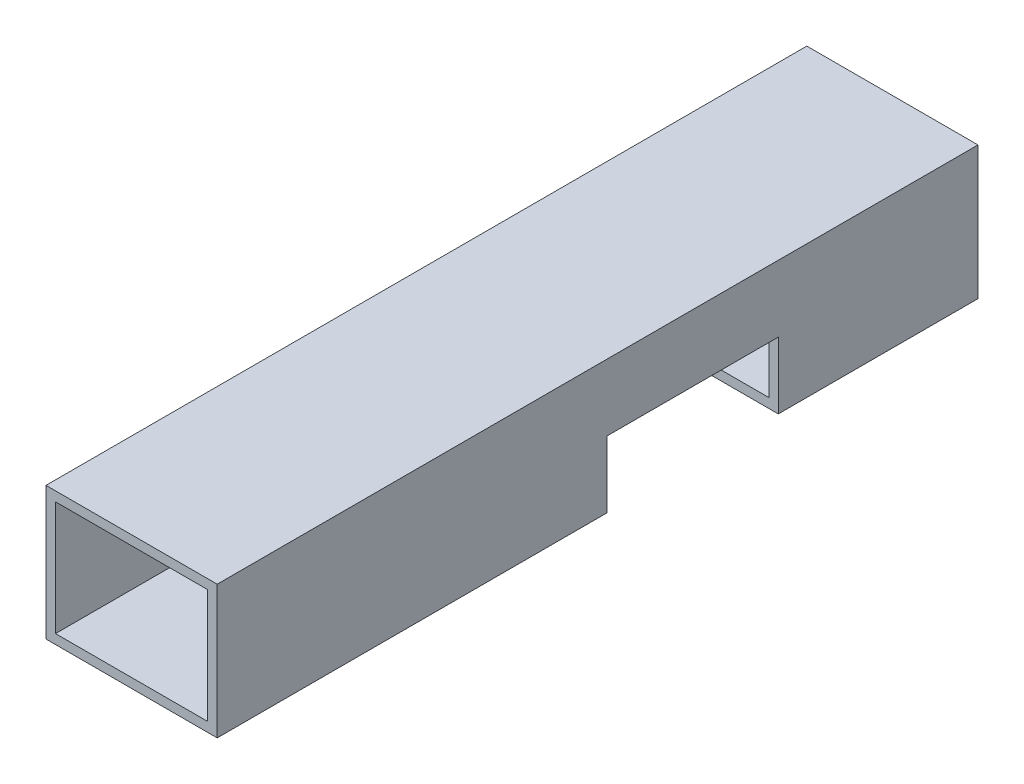
ISO-10303-21;
HEADER;
FILE_DESCRIPTION(('STEP AP214'),'2;1');
FILE_NAME('part.step','',(''),(''),'','','');
FILE_SCHEMA(('AUTOMOTIVE_DESIGN { 1 0 10303 214 1 1 1 1 }'));
ENDSEC;
DATA;
#1=APPLICATION_CONTEXT('core data for automotive mechanical design processes');
#2=APPLICATION_PROTOCOL_DEFINITION('international standard','automotive_design',2000,#1);
#3=PRODUCT_CONTEXT('',#1,'mechanical');
#4=PRODUCT('Part','Part','',(#3));
#5=PRODUCT_RELATED_PRODUCT_CATEGORY('part','',(#4));
#6=PRODUCT_DEFINITION_FORMATION('','',#4);
#7=PRODUCT_DEFINITION_CONTEXT('part definition',#1,'design');
#8=PRODUCT_DEFINITION('design','',#6,#7);
#9=PRODUCT_DEFINITION_SHAPE('','',#8);
#10=(LENGTH_UNIT() NAMED_UNIT(*) SI_UNIT(.MILLI.,.METRE.));
#11=(NAMED_UNIT(*) PLANE_ANGLE_UNIT() SI_UNIT($,.RADIAN.));
#12=(NAMED_UNIT(*) SI_UNIT($,.STERADIAN.) SOLID_ANGLE_UNIT());
#13=UNCERTAINTY_MEASURE_WITH_UNIT(LENGTH_MEASURE(1.E-05),#10,'distance_accuracy_value','');
#14=(GEOMETRIC_REPRESENTATION_CONTEXT(3) GLOBAL_UNCERTAINTY_ASSIGNED_CONTEXT((#13)) GLOBAL_UNIT_ASSIGNED_CONTEXT((#10,
#11,#12)) REPRESENTATION_CONTEXT('',''));
#15=CARTESIAN_POINT('',(0.,0.,0.));
#16=DIRECTION('',(0.,0.,1.));
#17=DIRECTION('',(1.,0.,0.));
#18=AXIS2_PLACEMENT_3D('',#15,#16,#17);
#19=CARTESIAN_POINT('',(0.,0.,40.));
#20=DIRECTION('',(0.,1.,0.));
#21=DIRECTION('',(0.,0.,1.));
#22=AXIS2_PLACEMENT_3D('',#19,#20,#21);
#23=PLANE('',#22);
#24=DIRECTION('',(0.,0.,-1.));
#25=VECTOR('',#24,1.);
#26=CARTESIAN_POINT('',(9.,0.,40.));
#27=LINE('',#26,#25);
#28=CARTESIAN_POINT('',(9.,0.,10.5));
#29=VERTEX_POINT('',#28);
#30=CARTESIAN_POINT('',(9.,0.,0.));
#31=VERTEX_POINT('',#30);
#32=EDGE_CURVE('E170',#29,#31,#27,.T.);
#33=ORIENTED_EDGE('',*,*,#32,.F.);
#34=DIRECTION('',(1.,0.,0.));
#35=VECTOR('',#34,1.);
#36=CARTESIAN_POINT('',(-41.,0.,10.5));
#37=LINE('',#36,#35);
#38=CARTESIAN_POINT('',(0.,0.,10.5));
#39=VERTEX_POINT('',#38);
#40=EDGE_CURVE('E163',#39,#29,#37,.T.);
#41=ORIENTED_EDGE('',*,*,#40,.F.);
#42=DIRECTION('',(0.,0.,-1.));
#43=VECTOR('',#42,1.);
#44=CARTESIAN_POINT('',(0.,0.,40.));
#45=LINE('',#44,#43);
#46=CARTESIAN_POINT('',(0.,0.,0.));
#47=VERTEX_POINT('',#46);
#48=EDGE_CURVE('E169',#39,#47,#45,.T.);
#49=ORIENTED_EDGE('',*,*,#48,.T.);
#50=DIRECTION('',(1.,0.,0.));
#51=VECTOR('',#50,1.);
#52=CARTESIAN_POINT('',(0.,0.,0.));
#53=LINE('',#52,#51);
#54=EDGE_CURVE('E230',#47,#31,#53,.T.);
#55=ORIENTED_EDGE('',*,*,#54,.T.);
#56=EDGE_LOOP('',(#33,#41,#49,#55));
#57=FACE_BOUND('',#56,.T.);
#58=ADVANCED_FACE('F33',(#57),#23,.F.);
#59=CARTESIAN_POINT('',(0.500000000000001,0.499999999999999,40.));
#60=DIRECTION('',(0.,1.,0.));
#61=DIRECTION('',(0.,0.,1.));
#62=AXIS2_PLACEMENT_3D('',#59,#60,#61);
#63=PLANE('',#62);
#64=DIRECTION('',(-1.,0.,0.));
#65=VECTOR('',#64,1.);
#66=CARTESIAN_POINT('',(0.500000000000001,0.499999999999999,10.5));
#67=LINE('',#66,#65);
#68=CARTESIAN_POINT('',(8.5,0.499999999999999,10.5));
#69=VERTEX_POINT('',#68);
#70=CARTESIAN_POINT('',(0.500000000000001,0.499999999999999,10.5));
#71=VERTEX_POINT('',#70);
#72=EDGE_CURVE('E41',#69,#71,#67,.T.);
#73=ORIENTED_EDGE('',*,*,#72,.F.);
#74=DIRECTION('',(0.,0.,-1.));
#75=VECTOR('',#74,1.);
#76=CARTESIAN_POINT('',(8.5,0.499999999999999,40.));
#77=LINE('',#76,#75);
#78=CARTESIAN_POINT('',(8.5,0.499999999999999,0.));
#79=VERTEX_POINT('',#78);
#80=EDGE_CURVE('E209',#69,#79,#77,.T.);
#81=ORIENTED_EDGE('',*,*,#80,.T.);
#82=DIRECTION('',(1.,0.,0.));
#83=VECTOR('',#82,1.);
#84=CARTESIAN_POINT('',(0.500000000000001,0.499999999999999,0.));
#85=LINE('',#84,#83);
#86=CARTESIAN_POINT('',(0.500000000000001,0.499999999999999,0.));
#87=VERTEX_POINT('',#86);
#88=EDGE_CURVE('E201',#87,#79,#85,.T.);
#89=ORIENTED_EDGE('',*,*,#88,.F.);
#90=DIRECTION('',(0.,0.,-1.));
#91=VECTOR('',#90,1.);
#92=CARTESIAN_POINT('',(0.500000000000001,0.499999999999999,40.));
#93=LINE('',#92,#91);
#94=EDGE_CURVE('E195',#71,#87,#93,.T.);
#95=ORIENTED_EDGE('',*,*,#94,.F.);
#96=EDGE_LOOP('',(#73,#81,#89,#95));
#97=FACE_BOUND('',#96,.T.);
#98=ADVANCED_FACE('F199',(#97),#63,.T.);
#99=CARTESIAN_POINT('',(0.,7.,40.));
#100=DIRECTION('',(0.,0.,-1.));
#101=DIRECTION('',(-1.,0.,0.));
#102=AXIS2_PLACEMENT_3D('',#99,#100,#101);
#103=PLANE('',#102);
#104=DIRECTION('',(0.,-1.,0.));
#105=VECTOR('',#104,1.);
#106=CARTESIAN_POINT('',(0.,0.,40.));
#107=LINE('',#106,#105);
#108=CARTESIAN_POINT('',(0.,7.,40.));
#109=VERTEX_POINT('',#108);
#110=CARTESIAN_POINT('',(0.,0.,40.));
#111=VERTEX_POINT('',#110);
#112=EDGE_CURVE('E218',#109,#111,#107,.T.);
#113=ORIENTED_EDGE('',*,*,#112,.T.);
#114=DIRECTION('',(1.,0.,0.));
#115=VECTOR('',#114,1.);
#116=CARTESIAN_POINT('',(0.,0.,40.));
#117=LINE('',#116,#115);
#118=CARTESIAN_POINT('',(9.,0.,40.));
#119=VERTEX_POINT('',#118);
#120=EDGE_CURVE('E221',#111,#119,#117,.T.);
#121=ORIENTED_EDGE('',*,*,#120,.T.);
#122=DIRECTION('',(0.,1.,0.));
#123=VECTOR('',#122,1.);
#124=CARTESIAN_POINT('',(9.,0.,40.));
#125=LINE('',#124,#123);
#126=CARTESIAN_POINT('',(9.,7.,40.));
#127=VERTEX_POINT('',#126);
#128=EDGE_CURVE('E168',#119,#127,#125,.T.);
#129=ORIENTED_EDGE('',*,*,#128,.T.);
#130=DIRECTION('',(-1.,0.,0.));
#131=VECTOR('',#130,1.);
#132=CARTESIAN_POINT('',(0.,7.,40.));
#133=LINE('',#132,#131);
#134=EDGE_CURVE('E225',#127,#109,#133,.T.);
#135=ORIENTED_EDGE('',*,*,#134,.T.);
#136=EDGE_LOOP('',(#113,#121,#129,#135));
#137=FACE_BOUND('',#136,.T.);
#138=DIRECTION('',(0.,1.,0.));
#139=VECTOR('',#138,1.);
#140=CARTESIAN_POINT('',(8.5,0.499999999999999,40.));
#141=LINE('',#140,#139);
#142=CARTESIAN_POINT('',(8.5,0.499999999999999,40.));
#143=VERTEX_POINT('',#142);
#144=CARTESIAN_POINT('',(8.5,6.5,40.));
#145=VERTEX_POINT('',#144);
#146=EDGE_CURVE('E277',#143,#145,#141,.T.);
#147=ORIENTED_EDGE('',*,*,#146,.F.);
#148=DIRECTION('',(1.,0.,0.));
#149=VECTOR('',#148,1.);
#150=CARTESIAN_POINT('',(0.500000000000001,0.499999999999999,40.));
#151=LINE('',#150,#149);
#152=CARTESIAN_POINT('',(0.500000000000001,0.499999999999999,40.));
#153=VERTEX_POINT('',#152);
#154=EDGE_CURVE('E284',#153,#143,#151,.T.);
#155=ORIENTED_EDGE('',*,*,#154,.F.);
#156=DIRECTION('',(0.,-1.,0.));
#157=VECTOR('',#156,1.);
#158=CARTESIAN_POINT('',(0.500000000000001,0.499999999999999,40.));
#159=LINE('',#158,#157);
#160=CARTESIAN_POINT('',(0.500000000000001,6.5,40.));
#161=VERTEX_POINT('',#160);
#162=EDGE_CURVE('E281',#161,#153,#159,.T.);
#163=ORIENTED_EDGE('',*,*,#162,.F.);
#164=DIRECTION('',(-1.,0.,0.));
#165=VECTOR('',#164,1.);
#166=CARTESIAN_POINT('',(0.500000000000001,6.5,40.));
#167=LINE('',#166,#165);
#168=EDGE_CURVE('E279',#145,#161,#167,.T.);
#169=ORIENTED_EDGE('',*,*,#168,.F.);
#170=EDGE_LOOP('',(#147,#155,#163,#169));
#171=FACE_BOUND('',#170,.T.);
#172=ADVANCED_FACE('F300',(#137,#171),#103,.F.);
#173=CARTESIAN_POINT('',(0.,7.,0.));
#174=DIRECTION('',(0.,0.,-1.));
#175=DIRECTION('',(-1.,0.,0.));
#176=AXIS2_PLACEMENT_3D('',#173,#174,#175);
#177=PLANE('',#176);
#178=DIRECTION('',(0.,-1.,0.));
#179=VECTOR('',#178,1.);
#180=CARTESIAN_POINT('',(0.,0.,0.));
#181=LINE('',#180,#179);
#182=CARTESIAN_POINT('',(0.,7.,0.));
#183=VERTEX_POINT('',#182);
#184=EDGE_CURVE('E217',#183,#47,#181,.T.);
#185=ORIENTED_EDGE('',*,*,#184,.F.);
#186=DIRECTION('',(-1.,0.,0.));
#187=VECTOR('',#186,1.);
#188=CARTESIAN_POINT('',(0.,7.,0.));
#189=LINE('',#188,#187);
#190=CARTESIAN_POINT('',(9.,7.,0.));
#191=VERTEX_POINT('',#190);
#192=EDGE_CURVE('E222',#191,#183,#189,.T.);
#193=ORIENTED_EDGE('',*,*,#192,.F.);
#194=DIRECTION('',(0.,1.,0.));
#195=VECTOR('',#194,1.);
#196=CARTESIAN_POINT('',(9.,0.,0.));
#197=LINE('',#196,#195);
#198=EDGE_CURVE('E233',#31,#191,#197,.T.);
#199=ORIENTED_EDGE('',*,*,#198,.F.);
#200=ORIENTED_EDGE('',*,*,#54,.F.);
#201=EDGE_LOOP('',(#185,#193,#199,#200));
#202=FACE_BOUND('',#201,.T.);
#203=ORIENTED_EDGE('',*,*,#88,.T.);
#204=DIRECTION('',(0.,1.,0.));
#205=VECTOR('',#204,1.);
#206=CARTESIAN_POINT('',(8.5,0.499999999999999,0.));
#207=LINE('',#206,#205);
#208=CARTESIAN_POINT('',(8.5,6.5,0.));
#209=VERTEX_POINT('',#208);
#210=EDGE_CURVE('E276',#79,#209,#207,.T.);
#211=ORIENTED_EDGE('',*,*,#210,.T.);
#212=DIRECTION('',(-1.,0.,0.));
#213=VECTOR('',#212,1.);
#214=CARTESIAN_POINT('',(0.500000000000001,6.5,0.));
#215=LINE('',#214,#213);
#216=CARTESIAN_POINT('',(0.500000000000001,6.5,0.));
#217=VERTEX_POINT('',#216);
#218=EDGE_CURVE('E288',#209,#217,#215,.T.);
#219=ORIENTED_EDGE('',*,*,#218,.T.);
#220=DIRECTION('',(0.,-1.,0.));
#221=VECTOR('',#220,1.);
#222=CARTESIAN_POINT('',(0.500000000000001,0.499999999999999,0.));
#223=LINE('',#222,#221);
#224=EDGE_CURVE('E291',#217,#87,#223,.T.);
#225=ORIENTED_EDGE('',*,*,#224,.T.);
#226=EDGE_LOOP('',(#203,#211,#219,#225));
#227=FACE_BOUND('',#226,.T.);
#228=ADVANCED_FACE('F247',(#202,#227),#177,.T.);
#229=CARTESIAN_POINT('',(0.,0.,40.));
#230=DIRECTION('',(1.,0.,0.));
#231=DIRECTION('',(0.,0.,-1.));
#232=AXIS2_PLACEMENT_3D('',#229,#230,#231);
#233=PLANE('',#232);
#234=ORIENTED_EDGE('',*,*,#48,.F.);
#235=DIRECTION('',(0.,1.,0.));
#236=VECTOR('',#235,1.);
#237=CARTESIAN_POINT('',(0.,0.,10.5));
#238=LINE('',#237,#236);
#239=CARTESIAN_POINT('',(0.,3.5,10.5));
#240=VERTEX_POINT('',#239);
#241=EDGE_CURVE('E253',#39,#240,#238,.T.);
#242=ORIENTED_EDGE('',*,*,#241,.T.);
#243=DIRECTION('',(0.,0.,1.));
#244=VECTOR('',#243,1.);
#245=CARTESIAN_POINT('',(0.,3.5,40.));
#246=LINE('',#245,#244);
#247=CARTESIAN_POINT('',(0.,3.5,19.5));
#248=VERTEX_POINT('',#247);
#249=EDGE_CURVE('E274',#240,#248,#246,.T.);
#250=ORIENTED_EDGE('',*,*,#249,.T.);
#251=DIRECTION('',(0.,-1.,0.));
#252=VECTOR('',#251,1.);
#253=CARTESIAN_POINT('',(0.,0.,19.5));
#254=LINE('',#253,#252);
#255=CARTESIAN_POINT('',(0.,0.,19.5));
#256=VERTEX_POINT('',#255);
#257=EDGE_CURVE('E197',#248,#256,#254,.T.);
#258=ORIENTED_EDGE('',*,*,#257,.T.);
#259=EDGE_CURVE('E162',#111,#256,#45,.T.);
#260=ORIENTED_EDGE('',*,*,#259,.F.);
#261=ORIENTED_EDGE('',*,*,#112,.F.);
#262=DIRECTION('',(0.,0.,-1.));
#263=VECTOR('',#262,1.);
#264=CARTESIAN_POINT('',(0.,7.,40.));
#265=LINE('',#264,#263);
#266=EDGE_CURVE('E227',#109,#183,#265,.T.);
#267=ORIENTED_EDGE('',*,*,#266,.T.);
#268=ORIENTED_EDGE('',*,*,#184,.T.);
#269=EDGE_LOOP('',(#234,#242,#250,#258,#260,#261,#267,#268));
#270=FACE_BOUND('',#269,.T.);
#271=ADVANCED_FACE('F35',(#270),#233,.F.);
#272=ORIENTED_EDGE('',*,*,#259,.T.);
#273=DIRECTION('',(1.,0.,0.));
#274=VECTOR('',#273,1.);
#275=CARTESIAN_POINT('',(-41.,0.,19.5));
#276=LINE('',#275,#274);
#277=CARTESIAN_POINT('',(9.,0.,19.5));
#278=VERTEX_POINT('',#277);
#279=EDGE_CURVE('E148',#256,#278,#276,.T.);
#280=ORIENTED_EDGE('',*,*,#279,.T.);
#281=EDGE_CURVE('E159',#119,#278,#27,.T.);
#282=ORIENTED_EDGE('',*,*,#281,.F.);
#283=ORIENTED_EDGE('',*,*,#120,.F.);
#284=EDGE_LOOP('',(#272,#280,#282,#283));
#285=FACE_BOUND('',#284,.T.);
#286=ADVANCED_FACE('F158',(#285),#23,.F.);
#287=CARTESIAN_POINT('',(9.,0.,40.));
#288=DIRECTION('',(-1.,0.,0.));
#289=DIRECTION('',(0.,0.,1.));
#290=AXIS2_PLACEMENT_3D('',#287,#288,#289);
#291=PLANE('',#290);
#292=DIRECTION('',(0.,0.,1.));
#293=VECTOR('',#292,1.);
#294=CARTESIAN_POINT('',(9.,3.5,19.5));
#295=LINE('',#294,#293);
#296=CARTESIAN_POINT('',(9.,3.5,10.5));
#297=VERTEX_POINT('',#296);
#298=CARTESIAN_POINT('',(9.,3.5,19.5));
#299=VERTEX_POINT('',#298);
#300=EDGE_CURVE('E48',#297,#299,#295,.T.);
#301=ORIENTED_EDGE('',*,*,#300,.F.);
#302=DIRECTION('',(0.,1.,0.));
#303=VECTOR('',#302,1.);
#304=CARTESIAN_POINT('',(9.,0.,10.5));
#305=LINE('',#304,#303);
#306=EDGE_CURVE('E153',#29,#297,#305,.T.);
#307=ORIENTED_EDGE('',*,*,#306,.F.);
#308=ORIENTED_EDGE('',*,*,#32,.T.);
#309=ORIENTED_EDGE('',*,*,#198,.T.);
#310=DIRECTION('',(0.,0.,-1.));
#311=VECTOR('',#310,1.);
#312=CARTESIAN_POINT('',(9.,7.,40.));
#313=LINE('',#312,#311);
#314=EDGE_CURVE('E173',#127,#191,#313,.T.);
#315=ORIENTED_EDGE('',*,*,#314,.F.);
#316=ORIENTED_EDGE('',*,*,#128,.F.);
#317=ORIENTED_EDGE('',*,*,#281,.T.);
#318=DIRECTION('',(0.,-1.,0.));
#319=VECTOR('',#318,1.);
#320=CARTESIAN_POINT('',(9.,0.,19.5));
#321=LINE('',#320,#319);
#322=EDGE_CURVE('E145',#299,#278,#321,.T.);
#323=ORIENTED_EDGE('',*,*,#322,.F.);
#324=EDGE_LOOP('',(#301,#307,#308,#309,#315,#316,#317,#323));
#325=FACE_BOUND('',#324,.T.);
#326=ADVANCED_FACE('F166',(#325),#291,.F.);
#327=CARTESIAN_POINT('',(0.,7.,40.));
#328=DIRECTION('',(0.,-1.,0.));
#329=DIRECTION('',(0.,0.,-1.));
#330=AXIS2_PLACEMENT_3D('',#327,#328,#329);
#331=PLANE('',#330);
#332=ORIENTED_EDGE('',*,*,#192,.T.);
#333=ORIENTED_EDGE('',*,*,#266,.F.);
#334=ORIENTED_EDGE('',*,*,#134,.F.);
#335=ORIENTED_EDGE('',*,*,#314,.T.);
#336=EDGE_LOOP('',(#332,#333,#334,#335));
#337=FACE_BOUND('',#336,.T.);
#338=ADVANCED_FACE('F244',(#337),#331,.F.);
#339=CARTESIAN_POINT('',(8.5,0.499999999999999,40.));
#340=DIRECTION('',(-1.,0.,0.));
#341=DIRECTION('',(0.,0.,1.));
#342=AXIS2_PLACEMENT_3D('',#339,#340,#341);
#343=PLANE('',#342);
#344=DIRECTION('',(0.,-1.,0.));
#345=VECTOR('',#344,1.);
#346=CARTESIAN_POINT('',(8.5,0.499999999999999,10.5));
#347=LINE('',#346,#345);
#348=CARTESIAN_POINT('',(8.5,3.5,10.5));
#349=VERTEX_POINT('',#348);
#350=EDGE_CURVE('E187',#349,#69,#347,.T.);
#351=ORIENTED_EDGE('',*,*,#350,.F.);
#352=DIRECTION('',(0.,0.,-1.));
#353=VECTOR('',#352,1.);
#354=CARTESIAN_POINT('',(8.5,3.5,40.));
#355=LINE('',#354,#353);
#356=CARTESIAN_POINT('',(8.5,3.5,19.5));
#357=VERTEX_POINT('',#356);
#358=EDGE_CURVE('E272',#357,#349,#355,.T.);
#359=ORIENTED_EDGE('',*,*,#358,.F.);
#360=DIRECTION('',(0.,1.,0.));
#361=VECTOR('',#360,1.);
#362=CARTESIAN_POINT('',(8.5,0.499999999999999,19.5));
#363=LINE('',#362,#361);
#364=CARTESIAN_POINT('',(8.5,0.499999999999999,19.5));
#365=VERTEX_POINT('',#364);
#366=EDGE_CURVE('E267',#365,#357,#363,.T.);
#367=ORIENTED_EDGE('',*,*,#366,.F.);
#368=EDGE_CURVE('E204',#143,#365,#77,.T.);
#369=ORIENTED_EDGE('',*,*,#368,.F.);
#370=ORIENTED_EDGE('',*,*,#146,.T.);
#371=DIRECTION('',(0.,0.,-1.));
#372=VECTOR('',#371,1.);
#373=CARTESIAN_POINT('',(8.5,6.5,40.));
#374=LINE('',#373,#372);
#375=EDGE_CURVE('E214',#145,#209,#374,.T.);
#376=ORIENTED_EDGE('',*,*,#375,.T.);
#377=ORIENTED_EDGE('',*,*,#210,.F.);
#378=ORIENTED_EDGE('',*,*,#80,.F.);
#379=EDGE_LOOP('',(#351,#359,#367,#369,#370,#376,#377,#378));
#380=FACE_BOUND('',#379,.T.);
#381=ADVANCED_FACE('F306',(#380),#343,.T.);
#382=CARTESIAN_POINT('',(0.500000000000001,6.5,40.));
#383=DIRECTION('',(0.,-1.,0.));
#384=DIRECTION('',(0.,0.,-1.));
#385=AXIS2_PLACEMENT_3D('',#382,#383,#384);
#386=PLANE('',#385);
#387=ORIENTED_EDGE('',*,*,#218,.F.);
#388=ORIENTED_EDGE('',*,*,#375,.F.);
#389=ORIENTED_EDGE('',*,*,#168,.T.);
#390=DIRECTION('',(0.,0.,-1.));
#391=VECTOR('',#390,1.);
#392=CARTESIAN_POINT('',(0.500000000000001,6.5,40.));
#393=LINE('',#392,#391);
#394=EDGE_CURVE('E207',#161,#217,#393,.T.);
#395=ORIENTED_EDGE('',*,*,#394,.T.);
#396=EDGE_LOOP('',(#387,#388,#389,#395));
#397=FACE_BOUND('',#396,.T.);
#398=ADVANCED_FACE('F310',(#397),#386,.T.);
#399=CARTESIAN_POINT('',(0.500000000000001,0.499999999999999,40.));
#400=DIRECTION('',(1.,0.,0.));
#401=DIRECTION('',(0.,0.,-1.));
#402=AXIS2_PLACEMENT_3D('',#399,#400,#401);
#403=PLANE('',#402);
#404=DIRECTION('',(0.,1.,0.));
#405=VECTOR('',#404,1.);
#406=CARTESIAN_POINT('',(0.500000000000001,0.499999999999999,10.5));
#407=LINE('',#406,#405);
#408=CARTESIAN_POINT('',(0.5,3.5,10.5));
#409=VERTEX_POINT('',#408);
#410=EDGE_CURVE('E183',#71,#409,#407,.T.);
#411=ORIENTED_EDGE('',*,*,#410,.F.);
#412=ORIENTED_EDGE('',*,*,#94,.T.);
#413=ORIENTED_EDGE('',*,*,#224,.F.);
#414=ORIENTED_EDGE('',*,*,#394,.F.);
#415=ORIENTED_EDGE('',*,*,#162,.T.);
#416=CARTESIAN_POINT('',(0.500000000000001,0.499999999999999,19.5));
#417=VERTEX_POINT('',#416);
#418=EDGE_CURVE('E203',#153,#417,#93,.T.);
#419=ORIENTED_EDGE('',*,*,#418,.T.);
#420=DIRECTION('',(0.,-1.,0.));
#421=VECTOR('',#420,1.);
#422=CARTESIAN_POINT('',(0.500000000000001,0.499999999999999,19.5));
#423=LINE('',#422,#421);
#424=CARTESIAN_POINT('',(0.5,3.5,19.5));
#425=VERTEX_POINT('',#424);
#426=EDGE_CURVE('E56',#425,#417,#423,.T.);
#427=ORIENTED_EDGE('',*,*,#426,.F.);
#428=DIRECTION('',(0.,0.,1.));
#429=VECTOR('',#428,1.);
#430=CARTESIAN_POINT('',(0.500000000000001,3.5,40.));
#431=LINE('',#430,#429);
#432=EDGE_CURVE('E11',#409,#425,#431,.T.);
#433=ORIENTED_EDGE('',*,*,#432,.F.);
#434=EDGE_LOOP('',(#411,#412,#413,#414,#415,#419,#427,#433));
#435=FACE_BOUND('',#434,.T.);
#436=ADVANCED_FACE('F193',(#435),#403,.T.);
#437=DIRECTION('',(1.,0.,0.));
#438=VECTOR('',#437,1.);
#439=CARTESIAN_POINT('',(0.500000000000001,0.499999999999999,19.5));
#440=LINE('',#439,#438);
#441=EDGE_CURVE('E177',#417,#365,#440,.T.);
#442=ORIENTED_EDGE('',*,*,#441,.F.);
#443=ORIENTED_EDGE('',*,*,#418,.F.);
#444=ORIENTED_EDGE('',*,*,#154,.T.);
#445=ORIENTED_EDGE('',*,*,#368,.T.);
#446=EDGE_LOOP('',(#442,#443,#444,#445));
#447=FACE_BOUND('',#446,.T.);
#448=ADVANCED_FACE('F303',(#447),#63,.T.);
#449=CARTESIAN_POINT('',(-41.,3.5,19.5));
#450=DIRECTION('',(0.,1.,0.));
#451=DIRECTION('',(0.,0.,1.));
#452=AXIS2_PLACEMENT_3D('',#449,#450,#451);
#453=PLANE('',#452);
#454=DIRECTION('',(1.,0.,0.));
#455=VECTOR('',#454,1.);
#456=CARTESIAN_POINT('',(-41.,3.5,10.5));
#457=LINE('',#456,#455);
#458=EDGE_CURVE('E261',#240,#409,#457,.T.);
#459=ORIENTED_EDGE('',*,*,#458,.T.);
#460=ORIENTED_EDGE('',*,*,#432,.T.);
#461=DIRECTION('',(1.,0.,0.));
#462=VECTOR('',#461,1.);
#463=CARTESIAN_POINT('',(-41.,3.5,19.5));
#464=LINE('',#463,#462);
#465=EDGE_CURVE('E164',#248,#425,#464,.T.);
#466=ORIENTED_EDGE('',*,*,#465,.F.);
#467=ORIENTED_EDGE('',*,*,#249,.F.);
#468=EDGE_LOOP('',(#459,#460,#466,#467));
#469=FACE_BOUND('',#468,.T.);
#470=ADVANCED_FACE('F367',(#469),#453,.F.);
#471=ORIENTED_EDGE('',*,*,#358,.T.);
#472=EDGE_CURVE('E259',#349,#297,#457,.T.);
#473=ORIENTED_EDGE('',*,*,#472,.T.);
#474=ORIENTED_EDGE('',*,*,#300,.T.);
#475=EDGE_CURVE('E150',#357,#299,#464,.T.);
#476=ORIENTED_EDGE('',*,*,#475,.F.);
#477=EDGE_LOOP('',(#471,#473,#474,#476));
#478=FACE_BOUND('',#477,.T.);
#479=ADVANCED_FACE('F309',(#478),#453,.F.);
#480=CARTESIAN_POINT('',(-41.,0.,10.5));
#481=DIRECTION('',(0.,0.,-1.));
#482=DIRECTION('',(-1.,0.,0.));
#483=AXIS2_PLACEMENT_3D('',#480,#481,#482);
#484=PLANE('',#483);
#485=ORIENTED_EDGE('',*,*,#40,.T.);
#486=ORIENTED_EDGE('',*,*,#306,.T.);
#487=ORIENTED_EDGE('',*,*,#472,.F.);
#488=ORIENTED_EDGE('',*,*,#350,.T.);
#489=ORIENTED_EDGE('',*,*,#72,.T.);
#490=ORIENTED_EDGE('',*,*,#410,.T.);
#491=ORIENTED_EDGE('',*,*,#458,.F.);
#492=ORIENTED_EDGE('',*,*,#241,.F.);
#493=EDGE_LOOP('',(#485,#486,#487,#488,#489,#490,#491,#492));
#494=FACE_BOUND('',#493,.T.);
#495=ADVANCED_FACE('F181',(#494),#484,.F.);
#496=CARTESIAN_POINT('',(-41.,0.,19.5));
#497=DIRECTION('',(0.,0.,1.));
#498=DIRECTION('',(1.,0.,0.));
#499=AXIS2_PLACEMENT_3D('',#496,#497,#498);
#500=PLANE('',#499);
#501=ORIENTED_EDGE('',*,*,#465,.T.);
#502=ORIENTED_EDGE('',*,*,#426,.T.);
#503=ORIENTED_EDGE('',*,*,#441,.T.);
#504=ORIENTED_EDGE('',*,*,#366,.T.);
#505=ORIENTED_EDGE('',*,*,#475,.T.);
#506=ORIENTED_EDGE('',*,*,#322,.T.);
#507=ORIENTED_EDGE('',*,*,#279,.F.);
#508=ORIENTED_EDGE('',*,*,#257,.F.);
#509=EDGE_LOOP('',(#501,#502,#503,#504,#505,#506,#507,#508));
#510=FACE_BOUND('',#509,.T.);
#511=ADVANCED_FACE('F147',(#510),#500,.F.);
#512=CLOSED_SHELL('',(#58,#98,#172,#228,#271,#286,#326,#338,#381,#398,#436,#448,#470,#479,#495,#511));
#513=MANIFOLD_SOLID_BREP('B2',#512);
#514=ADVANCED_BREP_SHAPE_REPRESENTATION('',(#18,#513),#14);
#515=SHAPE_DEFINITION_REPRESENTATION(#9,#514);
ENDSEC;
END-ISO-10303-21;
